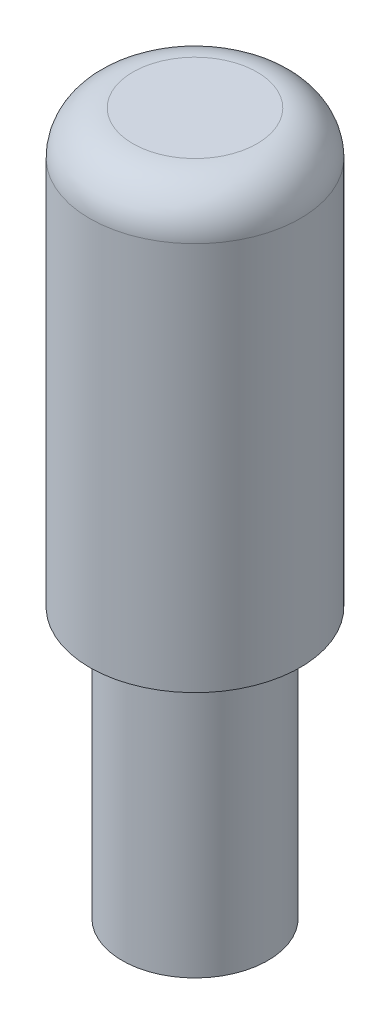
ISO-10303-21;
HEADER;
FILE_DESCRIPTION(('STEP AP214'),'2;1');
FILE_NAME('part.step','',(''),(''),'','','');
FILE_SCHEMA(('AUTOMOTIVE_DESIGN { 1 0 10303 214 1 1 1 1 }'));
ENDSEC;
DATA;
#1=APPLICATION_CONTEXT('core data for automotive mechanical design processes');
#2=APPLICATION_PROTOCOL_DEFINITION('international standard','automotive_design',2000,#1);
#3=PRODUCT_CONTEXT('',#1,'mechanical');
#4=PRODUCT('Part','Part','',(#3));
#5=PRODUCT_RELATED_PRODUCT_CATEGORY('part','',(#4));
#6=PRODUCT_DEFINITION_FORMATION('','',#4);
#7=PRODUCT_DEFINITION_CONTEXT('part definition',#1,'design');
#8=PRODUCT_DEFINITION('design','',#6,#7);
#9=PRODUCT_DEFINITION_SHAPE('','',#8);
#10=(LENGTH_UNIT() NAMED_UNIT(*) SI_UNIT(.MILLI.,.METRE.));
#11=(NAMED_UNIT(*) PLANE_ANGLE_UNIT() SI_UNIT($,.RADIAN.));
#12=(NAMED_UNIT(*) SI_UNIT($,.STERADIAN.) SOLID_ANGLE_UNIT());
#13=UNCERTAINTY_MEASURE_WITH_UNIT(LENGTH_MEASURE(1.E-05),#10,'distance_accuracy_value','');
#14=(GEOMETRIC_REPRESENTATION_CONTEXT(3) GLOBAL_UNCERTAINTY_ASSIGNED_CONTEXT((#13)) GLOBAL_UNIT_ASSIGNED_CONTEXT((#10,
#11,#12)) REPRESENTATION_CONTEXT('',''));
#15=CARTESIAN_POINT('',(0.,0.,0.));
#16=DIRECTION('',(0.,0.,1.));
#17=DIRECTION('',(1.,0.,0.));
#18=AXIS2_PLACEMENT_3D('',#15,#16,#17);
#19=CARTESIAN_POINT('',(0.,650.,0.));
#20=DIRECTION('',(0.,-1.,0.));
#21=DIRECTION('',(0.,0.,-1.));
#22=AXIS2_PLACEMENT_3D('',#19,#20,#21);
#23=CYLINDRICAL_SURFACE('',#22,97.5);
#24=CARTESIAN_POINT('',(0.,610.,0.));
#25=DIRECTION('',(0.,1.,0.));
#26=DIRECTION('',(0.,0.,1.));
#27=AXIS2_PLACEMENT_3D('',#24,#25,#26);
#28=CIRCLE('',#27,97.5);
#29=CARTESIAN_POINT('',(0.,610.,97.5));
#30=VERTEX_POINT('',#29);
#31=EDGE_CURVE('E10',#30,#30,#28,.F.);
#32=ORIENTED_EDGE('',*,*,#31,.T.);
#33=EDGE_LOOP('',(#32));
#34=FACE_BOUND('',#33,.T.);
#35=CARTESIAN_POINT('',(0.,517.5,-97.5));
#36=CARTESIAN_POINT('',(-0.841058769655879,517.500000131074,-97.5000001229896));
#37=CARTESIAN_POINT('',(-1.68211410689393,517.484275204085,-97.4891116312973));
#38=CARTESIAN_POINT('',(-3.3625733468422,517.421436789515,-97.445623930377));
#39=CARTESIAN_POINT('',(-4.20197707672122,517.374320175706,-97.4130225588109));
#40=CARTESIAN_POINT('',(-5.87722091904814,517.248893898886,-97.3263154491367));
#41=CARTESIAN_POINT('',(-6.71306148766499,517.170588357888,-97.2722125527299));
#42=CARTESIAN_POINT('',(-8.37971018981653,516.983085624979,-97.1428286429082));
#43=CARTESIAN_POINT('',(-9.21051776996125,516.873885096868,-97.0675453423283));
#44=CARTESIAN_POINT('',(-10.8655958541269,516.624990036185,-96.8962390654577));
#45=CARTESIAN_POINT('',(-11.6898647817588,516.485288368626,-96.8002112365534));
#46=CARTESIAN_POINT('',(-13.3302223700195,516.175916355791,-96.587987056246));
#47=CARTESIAN_POINT('',(-14.1463101496129,516.006242818687,-96.4717885568083));
#48=CARTESIAN_POINT('',(-15.7687155383474,515.637561585911,-96.2199114152539));
#49=CARTESIAN_POINT('',(-16.5750341022946,515.438556782407,-96.0842346937942));
#50=CARTESIAN_POINT('',(-18.1766731055127,515.011889158601,-95.7941612923735));
#51=CARTESIAN_POINT('',(-18.9719924192853,514.7842234293,-95.639762712258));
#52=CARTESIAN_POINT('',(-21.3315736543071,514.061763240673,-95.1513707260226));
#53=CARTESIAN_POINT('',(-22.8779586744453,513.525563939127,-94.7908477808735));
#54=CARTESIAN_POINT('',(-25.9135076979197,512.348948211736,-94.0063789180784));
#55=CARTESIAN_POINT('',(-27.4026720822885,511.708532480018,-93.5824334228558));
#56=CARTESIAN_POINT('',(-30.3174869793471,510.329917355252,-92.6791655127556));
#57=CARTESIAN_POINT('',(-31.743138054015,509.591718827635,-92.1998435879944));
#58=CARTESIAN_POINT('',(-34.5258511089924,508.023845938994,-91.1943250089744));
#59=CARTESIAN_POINT('',(-35.8829097302275,507.194167104361,-90.6681260625573));
#60=CARTESIAN_POINT('',(-38.6402805472691,505.372761066792,-89.5298475990137));
#61=CARTESIAN_POINT('',(-40.0339817579561,504.37320636702,-88.9142824248913));
#62=CARTESIAN_POINT('',(-42.7320513400252,502.27942494267,-87.6495410647169));
#63=CARTESIAN_POINT('',(-44.0364155064493,501.185193767293,-87.0003632990936));
#64=CARTESIAN_POINT('',(-46.5546722448273,498.906038745041,-85.6792672988249));
#65=CARTESIAN_POINT('',(-47.7684377473407,497.72099207349,-85.0073189777336));
#66=CARTESIAN_POINT('',(-50.1010073905835,495.265951678956,-83.6537960086101));
#67=CARTESIAN_POINT('',(-51.2198059981249,493.995953013995,-82.9722208023684));
#68=CARTESIAN_POINT('',(-53.5438526277285,491.148986538016,-81.4954754480966));
#69=CARTESIAN_POINT('',(-54.7308877983648,489.556784542845,-80.7009240543854));
#70=CARTESIAN_POINT('',(-56.9660666294683,486.263993423805,-79.1389657456395));
#71=CARTESIAN_POINT('',(-58.0141752763636,484.563377135673,-78.3715657091349));
#72=CARTESIAN_POINT('',(-59.4756432904379,481.935877701174,-77.2610669377098));
#73=CARTESIAN_POINT('',(-59.9441264360605,481.047783472077,-76.8978532075739));
#74=CARTESIAN_POINT('',(-60.8434455329142,479.246183538453,-76.18827437373));
#75=CARTESIAN_POINT('',(-61.2742804044033,478.3326771061,-75.841909753376));
#76=CARTESIAN_POINT('',(-62.5080329565272,475.555732567874,-74.8339659024154));
#77=CARTESIAN_POINT('',(-63.2529715295133,473.654484848413,-74.2029407011636));
#78=CARTESIAN_POINT('',(-64.3724522075475,470.358547826576,-73.2311880616067));
#79=CARTESIAN_POINT('',(-64.790544652281,468.987167434664,-72.8607586588913));
#80=CARTESIAN_POINT('',(-65.5416795781276,466.205322212768,-72.1858246415491));
#81=CARTESIAN_POINT('',(-65.8747358661739,464.794863768988,-71.8813093259761));
#82=CARTESIAN_POINT('',(-66.4507960080894,461.943752883125,-71.3491120682116));
#83=CARTESIAN_POINT('',(-66.6939461112358,460.503153541098,-71.1213053994296));
#84=CARTESIAN_POINT('',(-67.0869828480862,457.598311780572,-70.7506898904034));
#85=CARTESIAN_POINT('',(-67.2368695119559,456.134069369719,-70.6078810226669));
#86=CARTESIAN_POINT('',(-67.4411083426006,453.184854457998,-70.4128347794516));
#87=CARTESIAN_POINT('',(-67.494940013156,451.699812699854,-70.3610908811681));
#88=CARTESIAN_POINT('',(-67.5043785417708,448.729127512175,-70.3520356909658));
#89=CARTESIAN_POINT('',(-67.459985582757,447.243484083764,-70.3947242231826));
#90=CARTESIAN_POINT('',(-67.2738286324482,444.283068671458,-70.5726454290871));
#91=CARTESIAN_POINT('',(-67.1320051865069,442.808303881707,-70.7079346099417));
#92=CARTESIAN_POINT('',(-66.7536362818973,439.881727643169,-71.0652469462868));
#93=CARTESIAN_POINT('',(-66.517088771669,438.429916692232,-71.2872719803239));
#94=CARTESIAN_POINT('',(-65.9704393765082,435.645910752998,-71.7933189945174));
#95=CARTESIAN_POINT('',(-65.6656890511374,434.311812734073,-72.0727464451116));
#96=CARTESIAN_POINT('',(-64.9799912353044,431.677803227118,-72.6915662238878));
#97=CARTESIAN_POINT('',(-64.5990493075136,430.377889251182,-73.0309541742037));
#98=CARTESIAN_POINT('',(-63.7645147730452,427.815467528686,-73.7607193505714));
#99=CARTESIAN_POINT('',(-63.3108790810794,426.552982495256,-74.1511267901839));
#100=CARTESIAN_POINT('',(-62.3346744229028,424.068936487996,-74.9736360253282));
#101=CARTESIAN_POINT('',(-61.812094440811,422.847382093235,-75.4057444808568));
#102=CARTESIAN_POINT('',(-60.4151420304235,419.829277491387,-76.533836285721));
#103=CARTESIAN_POINT('',(-59.4980892583007,418.060193391293,-77.2512147100701));
#104=CARTESIAN_POINT('',(-58.0161474830264,415.483929468787,-78.3629970249596));
#105=CARTESIAN_POINT('',(-57.5042631313741,414.637816149105,-78.739666910215));
#106=CARTESIAN_POINT('',(-56.4457922829122,412.971681220428,-79.5018727406844));
#107=CARTESIAN_POINT('',(-55.8992065946864,412.151659004145,-79.8874084791797));
#108=CARTESIAN_POINT('',(-54.2066245309442,409.728680092151,-81.0541211889856));
#109=CARTESIAN_POINT('',(-53.0093230905132,408.165448346478,-81.8442482577446));
#110=CARTESIAN_POINT('',(-50.4837212715677,405.150125320249,-83.4258027761796));
#111=CARTESIAN_POINT('',(-49.1554371145908,403.698020316678,-84.2172300529237));
#112=CARTESIAN_POINT('',(-46.3568268550921,400.895439710074,-85.789851348241));
#113=CARTESIAN_POINT('',(-44.885139118274,399.546210631213,-86.5708467253269));
#114=CARTESIAN_POINT('',(-41.815601541671,396.974411864322,-88.0944949107013));
#115=CARTESIAN_POINT('',(-40.2177402288645,395.751853717963,-88.837144221986));
#116=CARTESIAN_POINT('',(-37.732599159874,394.022166220727,-89.9072516592096));
#117=CARTESIAN_POINT('',(-36.8901501829687,393.463337248748,-90.2564007795345));
#118=CARTESIAN_POINT('',(-35.1761946674018,392.381321483449,-90.9380857260168));
#119=CARTESIAN_POINT('',(-34.3046916433119,391.858130402265,-91.2706235495165));
#120=CARTESIAN_POINT('',(-32.5337664697387,390.848986108771,-91.9167682576983));
#121=CARTESIAN_POINT('',(-31.6343493315236,390.363026266253,-92.2303785109151));
#122=CARTESIAN_POINT('',(-29.8087919840112,389.429900791862,-92.8364753156058));
#123=CARTESIAN_POINT('',(-28.8826534851014,388.982732684306,-93.1289632149052));
#124=CARTESIAN_POINT('',(-26.4825572070576,387.891226830316,-93.8469429645498));
#125=CARTESIAN_POINT('',(-24.9904145873387,387.275560726021,-94.2559266238759));
#126=CARTESIAN_POINT('',(-21.9517006765951,386.148620830874,-95.0095953671133));
#127=CARTESIAN_POINT('',(-20.4051369659291,385.637332568098,-95.3542893641739));
#128=CARTESIAN_POINT('',(-17.266531413211,384.72530629406,-95.9722519280153));
#129=CARTESIAN_POINT('',(-15.674512886748,384.324512691232,-96.2455564083132));
#130=CARTESIAN_POINT('',(-12.454451018113,383.638517525164,-96.7149612880226));
#131=CARTESIAN_POINT('',(-10.8264069113131,383.353318417856,-96.9110600471115));
#132=CARTESIAN_POINT('',(-7.53974785300756,382.901833467091,-97.222101459197));
#133=CARTESIAN_POINT('',(-5.88103963745256,382.73600764206,-97.3367301367258));
#134=CARTESIAN_POINT('',(-2.55217998153672,382.52765424955,-97.4808276111811));
#135=CARTESIAN_POINT('',(-0.8820285460783,382.485126629253,-97.5102964445889));
#136=CARTESIAN_POINT('',(2.45612665393036,382.524050663574,-97.4833501574838));
#137=CARTESIAN_POINT('',(4.12413041115404,382.60550274002,-97.4269347447598));
#138=CARTESIAN_POINT('',(7.44448423057918,382.891087804018,-97.229601634782));
#139=CARTESIAN_POINT('',(9.09683477994216,383.095216960771,-97.0886865761737));
#140=CARTESIAN_POINT('',(12.2738167332787,383.606976303807,-96.736763553081));
#141=CARTESIAN_POINT('',(13.8001193986528,383.907583821032,-96.5305213015223));
#142=CARTESIAN_POINT('',(16.8182005718024,384.610407971798,-96.0506784096405));
#143=CARTESIAN_POINT('',(18.3099807717222,385.012619613573,-95.77708107846));
#144=CARTESIAN_POINT('',(21.2509611909264,385.914021898447,-95.167758787226));
#145=CARTESIAN_POINT('',(22.700157990089,386.413220306743,-94.8320288526584));
#146=CARTESIAN_POINT('',(25.5490529231857,387.503419782869,-94.1045045290518));
#147=CARTESIAN_POINT('',(26.9487482853309,388.094425981435,-93.7127070067372));
#148=CARTESIAN_POINT('',(29.7956147658313,389.410308730664,-92.8485127627575));
#149=CARTESIAN_POINT('',(31.2385210393806,390.141887770652,-92.3722814292721));
#150=CARTESIAN_POINT('',(34.0553647496094,391.698438572814,-91.3713129587121));
#151=CARTESIAN_POINT('',(35.4292994679814,392.523414011764,-90.8465739121632));
#152=CARTESIAN_POINT('',(38.1048837530086,394.261198788088,-89.7572020694093));
#153=CARTESIAN_POINT('',(39.4064944714931,395.174054623871,-89.1925481963159));
#154=CARTESIAN_POINT('',(41.933631748725,397.081878873506,-88.0326866505505));
#155=CARTESIAN_POINT('',(43.159154202171,398.076851711204,-87.4374773324357));
#156=CARTESIAN_POINT('',(45.7334563124867,400.320119872926,-86.1227567780688));
#157=CARTESIAN_POINT('',(47.0677818010393,401.582728114568,-85.399313182882));
#158=CARTESIAN_POINT('',(49.6258563322756,404.208247133162,-83.938633966364));
#159=CARTESIAN_POINT('',(50.8495889275213,405.571172774865,-83.2013963131873));
#160=CARTESIAN_POINT('',(53.1838049211151,408.393642759901,-81.7290525581094));
#161=CARTESIAN_POINT('',(54.2942128479666,409.853250437999,-80.9939481894175));
#162=CARTESIAN_POINT('',(56.3967753541518,412.864765044543,-79.5442252496152));
#163=CARTESIAN_POINT('',(57.3889454919879,414.416659788878,-78.8296039926225));
#164=CARTESIAN_POINT('',(59.1436520346959,417.427648891688,-77.519912021589));
#165=CARTESIAN_POINT('',(59.9194729027744,418.877117365786,-76.9205058727223));
#166=CARTESIAN_POINT('',(61.3695954992595,421.844202772217,-75.7685961823368));
#167=CARTESIAN_POINT('',(62.0438965136772,423.361820183745,-75.2160929706981));
#168=CARTESIAN_POINT('',(63.2839951939035,426.459304102406,-74.1757393383543));
#169=CARTESIAN_POINT('',(63.8499663044206,428.039066137575,-73.68778596187));
#170=CARTESIAN_POINT('',(64.867664792584,431.257476444707,-72.7935147031526));
#171=CARTESIAN_POINT('',(65.3194199173756,432.896110303908,-72.387176998496));
#172=CARTESIAN_POINT('',(66.0280312291772,435.911755500848,-71.7407415618537));
#173=CARTESIAN_POINT('',(66.3055419109814,437.280309696444,-71.483762985774));
#174=CARTESIAN_POINT('',(66.7763748667453,440.043636259976,-71.0441410429634));
#175=CARTESIAN_POINT('',(66.9697075658925,441.438405358944,-70.8614884713659));
#176=CARTESIAN_POINT('',(67.2689335025054,444.244218962747,-70.5774992355427));
#177=CARTESIAN_POINT('',(67.3749110091313,445.655246447696,-70.4760842063559));
#178=CARTESIAN_POINT('',(67.4978468283115,448.484788252271,-70.3583547399727));
#179=CARTESIAN_POINT('',(67.5148038910335,449.903302676732,-70.3420414975913));
#180=CARTESIAN_POINT('',(67.4593627868347,452.737593020832,-70.3952113161187));
#181=CARTESIAN_POINT('',(67.3869241020864,454.153367407195,-70.4647332810784));
#182=CARTESIAN_POINT('',(67.1539579042256,456.970978369522,-70.6867848438324));
#183=CARTESIAN_POINT('',(66.9934309191762,458.372815028987,-70.8393139440237));
#184=CARTESIAN_POINT('',(66.5867490614229,461.154998978869,-71.221713489735));
#185=CARTESIAN_POINT('',(66.340488506313,462.535317540032,-71.4516793788311));
#186=CARTESIAN_POINT('',(65.7660163823356,465.265246597227,-71.9807833555996));
#187=CARTESIAN_POINT('',(65.4377938477496,466.614852957881,-72.279930698684));
#188=CARTESIAN_POINT('',(64.5937777910564,469.675089263686,-73.0363174365625));
#189=CARTESIAN_POINT('',(64.0512383775696,471.373302143363,-73.5140958447887));
#190=CARTESIAN_POINT('',(62.8432903016605,474.700319298426,-74.5493317490452));
#191=CARTESIAN_POINT('',(62.1778433157733,476.329101729396,-75.1068140850503));
#192=CARTESIAN_POINT('',(60.7308320145228,479.514049443108,-76.2816185285041));
#193=CARTESIAN_POINT('',(59.9491324848465,481.070127355361,-76.8990100222664));
#194=CARTESIAN_POINT('',(58.2763425976617,484.104538286452,-78.1743179290407));
#195=CARTESIAN_POINT('',(57.3852590987321,485.582876171441,-78.8322317999365));
#196=CARTESIAN_POINT('',(55.4771144677629,488.491992245766,-80.1869032477321));
#197=CARTESIAN_POINT('',(54.4576714181876,489.920953883018,-80.8842015810297));
#198=CARTESIAN_POINT('',(52.3130890254323,492.692632858549,-82.2875015857658));
#199=CARTESIAN_POINT('',(51.1879498374726,494.035350323479,-82.9935032444217));
#200=CARTESIAN_POINT('',(48.8347172805761,496.6314355628,-84.3996449516463));
#201=CARTESIAN_POINT('',(47.6065930269225,497.884776323534,-85.0997831720627));
#202=CARTESIAN_POINT('',(45.0501719584955,500.297319306489,-86.4802969723416));
#203=CARTESIAN_POINT('',(43.7218657481426,501.456512677857,-87.1606706902781));
#204=CARTESIAN_POINT('',(41.5457857700001,503.209510176549,-88.2098993118906));
#205=CARTESIAN_POINT('',(40.7299427899988,503.836655034426,-88.589802795815));
#206=CARTESIAN_POINT('',(39.066343624892,505.055735307727,-89.3358914544837));
#207=CARTESIAN_POINT('',(38.2185904597825,505.647674041464,-89.7020779209015));
#208=CARTESIAN_POINT('',(36.4917300624657,506.795058082861,-90.4183484821805));
#209=CARTESIAN_POINT('',(35.6126134591042,507.350492339959,-90.7684276915536));
#210=CARTESIAN_POINT('',(33.8243931886395,508.423002501641,-91.4498537947872));
#211=CARTESIAN_POINT('',(32.9152937821163,508.940083822569,-91.7812033321429));
#212=CARTESIAN_POINT('',(31.0691760344544,509.933746870017,-92.4224546754079));
#213=CARTESIAN_POINT('',(30.1321877671728,510.410370229418,-92.7323784667856));
#214=CARTESIAN_POINT('',(28.2309826068363,511.321878348899,-93.3287414479659));
#215=CARTESIAN_POINT('',(27.2667696548899,511.7567691106,-93.6151840137686));
#216=CARTESIAN_POINT('',(25.3129379677866,512.582984574341,-94.1622756199132));
#217=CARTESIAN_POINT('',(24.3233246816418,512.974318525862,-94.4229301351498));
#218=CARTESIAN_POINT('',(22.3205703247798,513.711699087201,-94.9163078971732));
#219=CARTESIAN_POINT('',(21.3074309624801,514.057748973423,-95.1490331646039));
#220=CARTESIAN_POINT('',(19.4753093467485,514.634981850316,-95.5387127234386));
#221=CARTESIAN_POINT('',(18.6603007915605,514.875017213867,-95.7013093373722));
#222=CARTESIAN_POINT('',(17.0183064833653,515.324971199788,-96.0068985800616));
#223=CARTESIAN_POINT('',(16.1913200835958,515.534888189145,-96.1498901458164));
#224=CARTESIAN_POINT('',(14.5269891104443,515.923795359244,-96.4153857485531));
#225=CARTESIAN_POINT('',(13.6896461896107,516.102790407558,-96.5378930099703));
#226=CARTESIAN_POINT('',(12.0060231713148,516.429215447988,-96.7616997886046));
#227=CARTESIAN_POINT('',(11.1597431864686,516.576645837354,-96.8629995727233));
#228=CARTESIAN_POINT('',(9.46046752987578,516.839271167955,-97.0436968314115));
#229=CARTESIAN_POINT('',(8.60747684577776,516.954488081861,-97.1231092347402));
#230=CARTESIAN_POINT('',(6.89603458935004,517.152339235733,-97.259608961069));
#231=CARTESIAN_POINT('',(6.03758360121015,517.234976903646,-97.3166986328339));
#232=CARTESIAN_POINT('',(4.31688403856741,517.367344769873,-97.4081970531133));
#233=CARTESIAN_POINT('',(3.45463521818759,517.417072805085,-97.4426043107455));
#234=CARTESIAN_POINT('',(1.7282563841433,517.483400265393,-97.4885056605433));
#235=CARTESIAN_POINT('',(0.864126380431263,517.499999865331,-97.4999998736372));
#236=CARTESIAN_POINT('',(0.,517.5,-97.5));
#237=B_SPLINE_CURVE_WITH_KNOTS('',3,(#35,#36,#37,#38,#39,#40,#41,#42,#43,#44,#45,#46,#47,#48,
#49,#50,#51,#52,#53,#54,#55,#56,#57,#58,#59,#60,#61,#62,#63,#64,#65,#66,#67,#68,#69,#70,#71,#72,
#73,#74,#75,#76,#77,#78,#79,#80,#81,#82,#83,#84,#85,#86,#87,#88,#89,#90,#91,#92,#93,#94,#95,#96,
#97,#98,#99,#100,#101,#102,#103,#104,#105,#106,#107,#108,#109,#110,#111,#112,#113,#114,#115,
#116,#117,#118,#119,#120,#121,#122,#123,#124,#125,#126,#127,#128,#129,#130,#131,#132,#133,#134,
#135,#136,#137,#138,#139,#140,#141,#142,#143,#144,#145,#146,#147,#148,#149,#150,#151,#152,#153,
#154,#155,#156,#157,#158,#159,#160,#161,#162,#163,#164,#165,#166,#167,#168,#169,#170,#171,#172,
#173,#174,#175,#176,#177,#178,#179,#180,#181,#182,#183,#184,#185,#186,#187,#188,#189,#190,#191,
#192,#193,#194,#195,#196,#197,#198,#199,#200,#201,#202,#203,#204,#205,#206,#207,#208,#209,#210,
#211,#212,#213,#214,#215,#216,#217,#218,#219,#220,#221,#222,#223,#224,#225,#226,#227,#228,#229,
#230,#231,#232,#233,#234,#235,#236),.UNSPECIFIED.,.T.,.F.,(4,2,2,2,2,2,2,2,2,2,2,2,2,2,2,2,2,2,
2,2,2,2,2,2,2,2,2,2,2,2,2,2,2,2,2,2,2,2,2,2,2,2,2,2,2,2,2,2,2,2,2,2,2,2,2,2,2,2,2,2,2,2,2,2,2,2,
2,2,2,2,2,2,2,2,2,2,2,2,2,2,2,2,2,2,2,2,2,2,2,2,2,2,2,2,2,2,2,2,2,2,4),(0.,2.52295342733796,
5.0461581476677,7.56902950507501,10.0921733992525,12.6159081541152,15.1399118340571,
17.6636668044567,20.1876781353294,25.2093250898728,30.2309385994224,35.2525076679183,
40.274322412326,45.7356931034151,51.1973206764649,56.6664698868377,62.1359375354244,
68.545853207471,74.9573813075932,78.1596803481037,81.3620711995473,87.7617899575892,
92.2003681703993,96.6382252525443,101.068831233119,105.499435780628,109.953976503025,
114.4085089296,118.865762046424,123.323111704887,127.509235727504,131.69505423695,
135.883362902397,140.072341585806,146.416202604698,149.590118030262,152.763959526809,
159.121379428594,165.478012982991,171.902319252907,178.327210362141,181.534910399172,
184.742223809356,187.948964721333,191.155500828815,196.145535462019,201.134877759354,
206.121705241595,211.108638668887,216.114688402751,221.120735992093,226.126800613966,
231.132708921086,235.835225188828,240.537510468899,245.240172390385,249.943097217681,
254.997355483498,260.05181279165,265.108959318749,270.166378464783,276.083391549002,
282.001283171616,287.92309059591,293.844117927581,299.089316268742,304.334551497644,
309.571317125492,314.806809330714,319.062085655404,323.316834827044,327.567474739317,
331.818174329718,336.070801219684,340.323402616698,344.581264798093,348.839696945675,
354.368597007575,359.899223939573,365.436334641947,370.973098334325,376.634344569887,
382.295582491748,387.95852430491,393.621997879902,396.911803703789,400.201298957777,
403.491785457661,406.781806374535,410.06839961271,413.35451949097,416.639940210441,
419.925123090635,422.519463939346,425.11394539967,427.708018077291,430.302058105853,
432.894324410173,435.486317886615,438.078481714048,440.670631860766),.UNSPECIFIED.);
#238=CARTESIAN_POINT('',(0.,517.5,-97.5));
#239=VERTEX_POINT('',#238);
#240=EDGE_CURVE('E45',#239,#239,#237,.T.);
#241=ORIENTED_EDGE('',*,*,#240,.T.);
#242=EDGE_LOOP('',(#241));
#243=FACE_BOUND('',#242,.T.);
#244=CARTESIAN_POINT('',(0.,250.,0.));
#245=DIRECTION('',(0.,-1.,0.));
#246=DIRECTION('',(0.,0.,-1.));
#247=AXIS2_PLACEMENT_3D('',#244,#245,#246);
#248=CIRCLE('',#247,97.5);
#249=CARTESIAN_POINT('',(0.,250.,-97.5));
#250=VERTEX_POINT('',#249);
#251=EDGE_CURVE('E49',#250,#250,#248,.T.);
#252=ORIENTED_EDGE('',*,*,#251,.F.);
#253=EDGE_LOOP('',(#252));
#254=FACE_BOUND('',#253,.T.);
#255=ADVANCED_FACE('F34',(#34,#243,#254),#23,.T.);
#256=CARTESIAN_POINT('',(0.,650.,0.));
#257=DIRECTION('',(0.,1.,0.));
#258=DIRECTION('',(0.,0.,1.));
#259=AXIS2_PLACEMENT_3D('',#256,#257,#258);
#260=PLANE('',#259);
#261=CARTESIAN_POINT('',(0.,650.,0.));
#262=DIRECTION('',(0.,1.,0.));
#263=DIRECTION('',(0.,0.,1.));
#264=AXIS2_PLACEMENT_3D('',#261,#262,#263);
#265=CIRCLE('',#264,57.5);
#266=CARTESIAN_POINT('',(0.,650.,57.5));
#267=VERTEX_POINT('',#266);
#268=EDGE_CURVE('E41',#267,#267,#265,.T.);
#269=ORIENTED_EDGE('',*,*,#268,.T.);
#270=EDGE_LOOP('',(#269));
#271=FACE_BOUND('',#270,.T.);
#272=ADVANCED_FACE('F74',(#271),#260,.T.);
#273=CARTESIAN_POINT('',(0.,250.,0.));
#274=DIRECTION('',(0.,-1.,0.));
#275=DIRECTION('',(0.,0.,-1.));
#276=AXIS2_PLACEMENT_3D('',#273,#274,#275);
#277=PLANE('',#276);
#278=CARTESIAN_POINT('',(0.,250.,0.));
#279=DIRECTION('',(0.,-1.,0.));
#280=DIRECTION('',(0.,0.,-1.));
#281=AXIS2_PLACEMENT_3D('',#278,#279,#280);
#282=CIRCLE('',#281,67.5);
#283=CARTESIAN_POINT('',(0.,250.,-67.5));
#284=VERTEX_POINT('',#283);
#285=EDGE_CURVE('E91',#284,#284,#282,.T.);
#286=ORIENTED_EDGE('',*,*,#285,.F.);
#287=EDGE_LOOP('',(#286));
#288=FACE_BOUND('',#287,.T.);
#289=ORIENTED_EDGE('',*,*,#251,.T.);
#290=EDGE_LOOP('',(#289));
#291=FACE_BOUND('',#290,.T.);
#292=ADVANCED_FACE('F70',(#288,#291),#277,.T.);
#293=CARTESIAN_POINT('',(0.,250.,0.));
#294=DIRECTION('',(0.,-1.,0.));
#295=DIRECTION('',(0.,0.,-1.));
#296=AXIS2_PLACEMENT_3D('',#293,#294,#295);
#297=CYLINDRICAL_SURFACE('',#296,67.5);
#298=ORIENTED_EDGE('',*,*,#285,.T.);
#299=EDGE_LOOP('',(#298));
#300=FACE_BOUND('',#299,.T.);
#301=CARTESIAN_POINT('',(0.,0.,0.));
#302=DIRECTION('',(0.,-1.,0.));
#303=DIRECTION('',(0.,0.,-1.));
#304=AXIS2_PLACEMENT_3D('',#301,#302,#303);
#305=CIRCLE('',#304,67.5);
#306=CARTESIAN_POINT('',(0.,0.,-67.5));
#307=VERTEX_POINT('',#306);
#308=EDGE_CURVE('E93',#307,#307,#305,.T.);
#309=ORIENTED_EDGE('',*,*,#308,.F.);
#310=EDGE_LOOP('',(#309));
#311=FACE_BOUND('',#310,.T.);
#312=ADVANCED_FACE('F67',(#300,#311),#297,.T.);
#313=CARTESIAN_POINT('',(0.,0.,0.));
#314=DIRECTION('',(0.,1.,0.));
#315=DIRECTION('',(0.,0.,1.));
#316=AXIS2_PLACEMENT_3D('',#313,#314,#315);
#317=PLANE('',#316);
#318=ORIENTED_EDGE('',*,*,#308,.T.);
#319=EDGE_LOOP('',(#318));
#320=FACE_BOUND('',#319,.T.);
#321=ADVANCED_FACE('F65',(#320),#317,.F.);
#322=CARTESIAN_POINT('',(0.,450.,-97.5));
#323=DIRECTION('',(0.,0.,1.));
#324=DIRECTION('',(1.,0.,0.));
#325=AXIS2_PLACEMENT_3D('',#322,#323,#324);
#326=CYLINDRICAL_SURFACE('',#325,67.5);
#327=CARTESIAN_POINT('',(0.,450.,0.));
#328=DIRECTION('',(0.,0.,1.));
#329=DIRECTION('',(1.,0.,0.));
#330=AXIS2_PLACEMENT_3D('',#327,#328,#329);
#331=CIRCLE('',#330,67.5);
#332=CARTESIAN_POINT('',(67.5,450.,0.));
#333=VERTEX_POINT('',#332);
#334=EDGE_CURVE('E96',#333,#333,#331,.T.);
#335=ORIENTED_EDGE('',*,*,#334,.T.);
#336=EDGE_LOOP('',(#335));
#337=FACE_BOUND('',#336,.T.);
#338=ORIENTED_EDGE('',*,*,#240,.F.);
#339=EDGE_LOOP('',(#338));
#340=FACE_BOUND('',#339,.T.);
#341=ADVANCED_FACE('F59',(#337,#340),#326,.F.);
#342=CARTESIAN_POINT('',(0.,450.,0.));
#343=DIRECTION('',(0.,0.,1.));
#344=DIRECTION('',(1.,0.,0.));
#345=AXIS2_PLACEMENT_3D('',#342,#343,#344);
#346=PLANE('',#345);
#347=ORIENTED_EDGE('',*,*,#334,.F.);
#348=EDGE_LOOP('',(#347));
#349=FACE_BOUND('',#348,.T.);
#350=ADVANCED_FACE('F64',(#349),#346,.F.);
#351=CARTESIAN_POINT('',(0.,610.,0.));
#352=DIRECTION('',(0.,1.,0.));
#353=DIRECTION('',(0.,0.,1.));
#354=AXIS2_PLACEMENT_3D('',#351,#352,#353);
#355=TOROIDAL_SURFACE('',#354,57.5,40.);
#356=ORIENTED_EDGE('',*,*,#31,.F.);
#357=EDGE_LOOP('',(#356));
#358=FACE_BOUND('',#357,.T.);
#359=ORIENTED_EDGE('',*,*,#268,.F.);
#360=EDGE_LOOP('',(#359));
#361=FACE_BOUND('',#360,.T.);
#362=ADVANCED_FACE('F36',(#358,#361),#355,.T.);
#363=CLOSED_SHELL('',(#255,#272,#292,#312,#321,#341,#350,#362));
#364=MANIFOLD_SOLID_BREP('B2',#363);
#365=ADVANCED_BREP_SHAPE_REPRESENTATION('',(#18,#364),#14);
#366=SHAPE_DEFINITION_REPRESENTATION(#9,#365);
ENDSEC;
END-ISO-10303-21;
